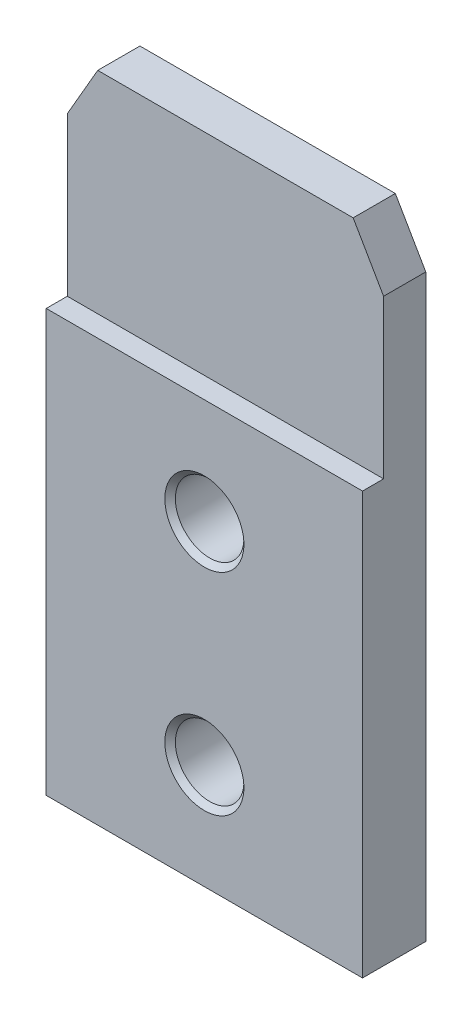
ISO-10303-21;
HEADER;
FILE_DESCRIPTION(('STEP AP214'),'2;1');
FILE_NAME('part.step','',(''),(''),'','','');
FILE_SCHEMA(('AUTOMOTIVE_DESIGN { 1 0 10303 214 1 1 1 1 }'));
ENDSEC;
DATA;
#1=APPLICATION_CONTEXT('core data for automotive mechanical design processes');
#2=APPLICATION_PROTOCOL_DEFINITION('international standard','automotive_design',2000,#1);
#3=PRODUCT_CONTEXT('',#1,'mechanical');
#4=PRODUCT('Part','Part','',(#3));
#5=PRODUCT_RELATED_PRODUCT_CATEGORY('part','',(#4));
#6=PRODUCT_DEFINITION_FORMATION('','',#4);
#7=PRODUCT_DEFINITION_CONTEXT('part definition',#1,'design');
#8=PRODUCT_DEFINITION('design','',#6,#7);
#9=PRODUCT_DEFINITION_SHAPE('','',#8);
#10=(LENGTH_UNIT() NAMED_UNIT(*) SI_UNIT(.MILLI.,.METRE.));
#11=(NAMED_UNIT(*) PLANE_ANGLE_UNIT() SI_UNIT($,.RADIAN.));
#12=(NAMED_UNIT(*) SI_UNIT($,.STERADIAN.) SOLID_ANGLE_UNIT());
#13=UNCERTAINTY_MEASURE_WITH_UNIT(LENGTH_MEASURE(1.E-05),#10,'distance_accuracy_value','');
#14=(GEOMETRIC_REPRESENTATION_CONTEXT(3) GLOBAL_UNCERTAINTY_ASSIGNED_CONTEXT((#13)) GLOBAL_UNIT_ASSIGNED_CONTEXT((#10,
#11,#12)) REPRESENTATION_CONTEXT('',''));
#15=CARTESIAN_POINT('',(0.,0.,0.));
#16=DIRECTION('',(0.,0.,1.));
#17=DIRECTION('',(1.,0.,0.));
#18=AXIS2_PLACEMENT_3D('',#15,#16,#17);
#19=CARTESIAN_POINT('',(0.,0.,6.));
#20=DIRECTION('',(0.,0.,-1.));
#21=DIRECTION('',(-1.,0.,0.));
#22=AXIS2_PLACEMENT_3D('',#19,#20,#21);
#23=PLANE('',#22);
#24=CARTESIAN_POINT('',(0.,0.,6.));
#25=DIRECTION('',(0.,0.,-1.));
#26=DIRECTION('',(-1.,0.,0.));
#27=AXIS2_PLACEMENT_3D('',#24,#25,#26);
#28=CIRCLE('',#27,3.75);
#29=CARTESIAN_POINT('',(-3.75,0.,6.));
#30=VERTEX_POINT('',#29);
#31=EDGE_CURVE('E176',#30,#30,#28,.T.);
#32=ORIENTED_EDGE('',*,*,#31,.T.);
#33=EDGE_LOOP('',(#32));
#34=FACE_BOUND('',#33,.T.);
#35=CARTESIAN_POINT('',(0.,-20.,6.));
#36=DIRECTION('',(0.,0.,-1.));
#37=DIRECTION('',(-1.,0.,0.));
#38=AXIS2_PLACEMENT_3D('',#35,#36,#37);
#39=CIRCLE('',#38,3.74999999999999);
#40=CARTESIAN_POINT('',(-3.74999999999999,-20.,6.));
#41=VERTEX_POINT('',#40);
#42=EDGE_CURVE('E173',#41,#41,#39,.T.);
#43=ORIENTED_EDGE('',*,*,#42,.T.);
#44=EDGE_LOOP('',(#43));
#45=FACE_BOUND('',#44,.T.);
#46=DIRECTION('',(1.,0.,0.));
#47=VECTOR('',#46,1.);
#48=CARTESIAN_POINT('',(-15.,10.,6.));
#49=LINE('',#48,#47);
#50=CARTESIAN_POINT('',(-15.,10.,6.));
#51=VERTEX_POINT('',#50);
#52=CARTESIAN_POINT('',(15.,10.,6.));
#53=VERTEX_POINT('',#52);
#54=EDGE_CURVE('E105',#51,#53,#49,.T.);
#55=ORIENTED_EDGE('',*,*,#54,.F.);
#56=DIRECTION('',(0.,-1.,0.));
#57=VECTOR('',#56,1.);
#58=CARTESIAN_POINT('',(-15.,-30.,6.));
#59=LINE('',#58,#57);
#60=CARTESIAN_POINT('',(-15.,-30.,6.));
#61=VERTEX_POINT('',#60);
#62=EDGE_CURVE('E116',#51,#61,#59,.T.);
#63=ORIENTED_EDGE('',*,*,#62,.T.);
#64=DIRECTION('',(1.,0.,0.));
#65=VECTOR('',#64,1.);
#66=CARTESIAN_POINT('',(-15.,-30.,6.));
#67=LINE('',#66,#65);
#68=CARTESIAN_POINT('',(15.,-30.,6.));
#69=VERTEX_POINT('',#68);
#70=EDGE_CURVE('E125',#61,#69,#67,.T.);
#71=ORIENTED_EDGE('',*,*,#70,.T.);
#72=DIRECTION('',(0.,1.,0.));
#73=VECTOR('',#72,1.);
#74=CARTESIAN_POINT('',(15.,-30.,6.));
#75=LINE('',#74,#73);
#76=EDGE_CURVE('E119',#69,#53,#75,.T.);
#77=ORIENTED_EDGE('',*,*,#76,.T.);
#78=EDGE_LOOP('',(#55,#63,#71,#77));
#79=FACE_BOUND('',#78,.T.);
#80=ADVANCED_FACE('F35',(#34,#45,#79),#23,.F.);
#81=CARTESIAN_POINT('',(15.,-30.,6.));
#82=DIRECTION('',(-1.,0.,0.));
#83=DIRECTION('',(0.,0.,1.));
#84=AXIS2_PLACEMENT_3D('',#81,#82,#83);
#85=PLANE('',#84);
#86=DIRECTION('',(0.,1.,0.));
#87=VECTOR('',#86,1.);
#88=CARTESIAN_POINT('',(15.,-30.,0.));
#89=LINE('',#88,#87);
#90=CARTESIAN_POINT('',(15.,-30.,0.));
#91=VERTEX_POINT('',#90);
#92=CARTESIAN_POINT('',(15.,25.,0.));
#93=VERTEX_POINT('',#92);
#94=EDGE_CURVE('E133',#91,#93,#89,.T.);
#95=ORIENTED_EDGE('',*,*,#94,.T.);
#96=DIRECTION('',(0.,0.,1.));
#97=VECTOR('',#96,1.);
#98=CARTESIAN_POINT('',(15.,25.,6.));
#99=LINE('',#98,#97);
#100=CARTESIAN_POINT('',(15.,25.,4.));
#101=VERTEX_POINT('',#100);
#102=EDGE_CURVE('E50',#93,#101,#99,.T.);
#103=ORIENTED_EDGE('',*,*,#102,.T.);
#104=DIRECTION('',(0.,-1.,0.));
#105=VECTOR('',#104,1.);
#106=CARTESIAN_POINT('',(15.,30.,4.));
#107=LINE('',#106,#105);
#108=CARTESIAN_POINT('',(15.,10.,4.));
#109=VERTEX_POINT('',#108);
#110=EDGE_CURVE('E351',#101,#109,#107,.T.);
#111=ORIENTED_EDGE('',*,*,#110,.T.);
#112=DIRECTION('',(0.,0.,1.));
#113=VECTOR('',#112,1.);
#114=CARTESIAN_POINT('',(15.,10.,6.));
#115=LINE('',#114,#113);
#116=EDGE_CURVE('E352',#109,#53,#115,.T.);
#117=ORIENTED_EDGE('',*,*,#116,.T.);
#118=ORIENTED_EDGE('',*,*,#76,.F.);
#119=DIRECTION('',(0.,0.,-1.));
#120=VECTOR('',#119,1.);
#121=CARTESIAN_POINT('',(15.,-30.,6.));
#122=LINE('',#121,#120);
#123=EDGE_CURVE('E127',#69,#91,#122,.T.);
#124=ORIENTED_EDGE('',*,*,#123,.T.);
#125=EDGE_LOOP('',(#95,#103,#111,#117,#118,#124));
#126=FACE_BOUND('',#125,.T.);
#127=ADVANCED_FACE('F193',(#126),#85,.F.);
#128=CARTESIAN_POINT('',(-15.,30.,6.));
#129=DIRECTION('',(0.,-1.,0.));
#130=DIRECTION('',(0.,0.,-1.));
#131=AXIS2_PLACEMENT_3D('',#128,#129,#130);
#132=PLANE('',#131);
#133=DIRECTION('',(1.,0.,0.));
#134=VECTOR('',#133,1.);
#135=CARTESIAN_POINT('',(-15.,30.,4.));
#136=LINE('',#135,#134);
#137=CARTESIAN_POINT('',(-12.1132486540519,30.,4.));
#138=VERTEX_POINT('',#137);
#139=CARTESIAN_POINT('',(12.1132486540519,30.,4.));
#140=VERTEX_POINT('',#139);
#141=EDGE_CURVE('E136',#138,#140,#136,.T.);
#142=ORIENTED_EDGE('',*,*,#141,.T.);
#143=DIRECTION('',(0.,0.,-1.));
#144=VECTOR('',#143,1.);
#145=CARTESIAN_POINT('',(12.1132486540519,30.,6.));
#146=LINE('',#145,#144);
#147=CARTESIAN_POINT('',(12.1132486540519,30.,0.));
#148=VERTEX_POINT('',#147);
#149=EDGE_CURVE('E154',#140,#148,#146,.T.);
#150=ORIENTED_EDGE('',*,*,#149,.T.);
#151=DIRECTION('',(-1.,0.,0.));
#152=VECTOR('',#151,1.);
#153=CARTESIAN_POINT('',(-15.,30.,0.));
#154=LINE('',#153,#152);
#155=CARTESIAN_POINT('',(-12.1132486540519,30.,0.));
#156=VERTEX_POINT('',#155);
#157=EDGE_CURVE('E135',#148,#156,#154,.T.);
#158=ORIENTED_EDGE('',*,*,#157,.T.);
#159=DIRECTION('',(0.,0.,1.));
#160=VECTOR('',#159,1.);
#161=CARTESIAN_POINT('',(-12.1132486540519,30.,6.));
#162=LINE('',#161,#160);
#163=EDGE_CURVE('E150',#156,#138,#162,.T.);
#164=ORIENTED_EDGE('',*,*,#163,.T.);
#165=EDGE_LOOP('',(#142,#150,#158,#164));
#166=FACE_BOUND('',#165,.T.);
#167=ADVANCED_FACE('F201',(#166),#132,.F.);
#168=CARTESIAN_POINT('',(-15.,-30.,6.));
#169=DIRECTION('',(1.,0.,0.));
#170=DIRECTION('',(0.,0.,-1.));
#171=AXIS2_PLACEMENT_3D('',#168,#169,#170);
#172=PLANE('',#171);
#173=DIRECTION('',(0.,-1.,0.));
#174=VECTOR('',#173,1.);
#175=CARTESIAN_POINT('',(-15.,30.,4.));
#176=LINE('',#175,#174);
#177=CARTESIAN_POINT('',(-15.,25.,4.));
#178=VERTEX_POINT('',#177);
#179=CARTESIAN_POINT('',(-15.,10.,4.));
#180=VERTEX_POINT('',#179);
#181=EDGE_CURVE('E112',#178,#180,#176,.T.);
#182=ORIENTED_EDGE('',*,*,#181,.F.);
#183=DIRECTION('',(0.,0.,-1.));
#184=VECTOR('',#183,1.);
#185=CARTESIAN_POINT('',(-15.,25.,6.));
#186=LINE('',#185,#184);
#187=CARTESIAN_POINT('',(-15.,25.,0.));
#188=VERTEX_POINT('',#187);
#189=EDGE_CURVE('E144',#178,#188,#186,.T.);
#190=ORIENTED_EDGE('',*,*,#189,.T.);
#191=DIRECTION('',(0.,-1.,0.));
#192=VECTOR('',#191,1.);
#193=CARTESIAN_POINT('',(-15.,-30.,0.));
#194=LINE('',#193,#192);
#195=CARTESIAN_POINT('',(-15.,-30.,0.));
#196=VERTEX_POINT('',#195);
#197=EDGE_CURVE('E138',#188,#196,#194,.T.);
#198=ORIENTED_EDGE('',*,*,#197,.T.);
#199=DIRECTION('',(0.,0.,-1.));
#200=VECTOR('',#199,1.);
#201=CARTESIAN_POINT('',(-15.,-30.,6.));
#202=LINE('',#201,#200);
#203=EDGE_CURVE('E123',#61,#196,#202,.T.);
#204=ORIENTED_EDGE('',*,*,#203,.F.);
#205=ORIENTED_EDGE('',*,*,#62,.F.);
#206=DIRECTION('',(0.,0.,1.));
#207=VECTOR('',#206,1.);
#208=CARTESIAN_POINT('',(-15.,10.,6.));
#209=LINE('',#208,#207);
#210=EDGE_CURVE('E101',#180,#51,#209,.T.);
#211=ORIENTED_EDGE('',*,*,#210,.F.);
#212=EDGE_LOOP('',(#182,#190,#198,#204,#205,#211));
#213=FACE_BOUND('',#212,.T.);
#214=ADVANCED_FACE('F121',(#213),#172,.F.);
#215=CARTESIAN_POINT('',(0.,0.,0.));
#216=DIRECTION('',(0.,0.,-1.));
#217=DIRECTION('',(-1.,0.,0.));
#218=AXIS2_PLACEMENT_3D('',#215,#216,#217);
#219=PLANE('',#218);
#220=CARTESIAN_POINT('',(0.,0.,0.));
#221=DIRECTION('',(0.,0.,-1.));
#222=DIRECTION('',(-1.,0.,0.));
#223=AXIS2_PLACEMENT_3D('',#220,#221,#222);
#224=CIRCLE('',#223,3.75000000000001);
#225=CARTESIAN_POINT('',(-3.75000000000001,0.,0.));
#226=VERTEX_POINT('',#225);
#227=EDGE_CURVE('E164',#226,#226,#224,.F.);
#228=ORIENTED_EDGE('',*,*,#227,.T.);
#229=EDGE_LOOP('',(#228));
#230=FACE_BOUND('',#229,.T.);
#231=CARTESIAN_POINT('',(0.,-20.,0.));
#232=DIRECTION('',(0.,0.,-1.));
#233=DIRECTION('',(-1.,0.,0.));
#234=AXIS2_PLACEMENT_3D('',#231,#232,#233);
#235=CIRCLE('',#234,3.74999999999999);
#236=CARTESIAN_POINT('',(-3.74999999999999,-20.,0.));
#237=VERTEX_POINT('',#236);
#238=EDGE_CURVE('E161',#237,#237,#235,.F.);
#239=ORIENTED_EDGE('',*,*,#238,.T.);
#240=EDGE_LOOP('',(#239));
#241=FACE_BOUND('',#240,.T.);
#242=ORIENTED_EDGE('',*,*,#157,.F.);
#243=DIRECTION('',(-0.499999999999998,0.86602540378444,0.));
#244=VECTOR('',#243,1.);
#245=CARTESIAN_POINT('',(22.0753175473055,12.7451905283832,0.));
#246=LINE('',#245,#244);
#247=EDGE_CURVE('E58',#148,#93,#246,.F.);
#248=ORIENTED_EDGE('',*,*,#247,.T.);
#249=ORIENTED_EDGE('',*,*,#94,.F.);
#250=DIRECTION('',(1.,0.,0.));
#251=VECTOR('',#250,1.);
#252=CARTESIAN_POINT('',(-15.,-30.,0.));
#253=LINE('',#252,#251);
#254=EDGE_CURVE('E129',#196,#91,#253,.T.);
#255=ORIENTED_EDGE('',*,*,#254,.F.);
#256=ORIENTED_EDGE('',*,*,#197,.F.);
#257=DIRECTION('',(-0.499999999999998,-0.86602540378444,0.));
#258=VECTOR('',#257,1.);
#259=CARTESIAN_POINT('',(-22.0753175473055,12.7451905283832,0.));
#260=LINE('',#259,#258);
#261=EDGE_CURVE('E147',#188,#156,#260,.F.);
#262=ORIENTED_EDGE('',*,*,#261,.T.);
#263=EDGE_LOOP('',(#242,#248,#249,#255,#256,#262));
#264=FACE_BOUND('',#263,.T.);
#265=ADVANCED_FACE('F207',(#230,#241,#264),#219,.T.);
#266=CARTESIAN_POINT('',(-15.,-30.,6.));
#267=DIRECTION('',(0.,1.,0.));
#268=DIRECTION('',(0.,0.,1.));
#269=AXIS2_PLACEMENT_3D('',#266,#267,#268);
#270=PLANE('',#269);
#271=ORIENTED_EDGE('',*,*,#254,.T.);
#272=ORIENTED_EDGE('',*,*,#123,.F.);
#273=ORIENTED_EDGE('',*,*,#70,.F.);
#274=ORIENTED_EDGE('',*,*,#203,.T.);
#275=EDGE_LOOP('',(#271,#272,#273,#274));
#276=FACE_BOUND('',#275,.T.);
#277=ADVANCED_FACE('F209',(#276),#270,.F.);
#278=CARTESIAN_POINT('',(0.,-20.,6.));
#279=DIRECTION('',(0.,0.,-1.));
#280=DIRECTION('',(-1.,0.,0.));
#281=AXIS2_PLACEMENT_3D('',#278,#279,#280);
#282=CYLINDRICAL_SURFACE('',#281,3.25);
#283=CARTESIAN_POINT('',(0.,-20.,0.499999999999992));
#284=DIRECTION('',(0.,0.,-1.));
#285=DIRECTION('',(-1.,0.,0.));
#286=AXIS2_PLACEMENT_3D('',#283,#284,#285);
#287=CIRCLE('',#286,3.25);
#288=CARTESIAN_POINT('',(-3.25,-20.,0.499999999999992));
#289=VERTEX_POINT('',#288);
#290=EDGE_CURVE('E11',#289,#289,#287,.T.);
#291=ORIENTED_EDGE('',*,*,#290,.T.);
#292=EDGE_LOOP('',(#291));
#293=FACE_BOUND('',#292,.T.);
#294=CARTESIAN_POINT('',(0.,-20.,5.50000000000002));
#295=DIRECTION('',(0.,0.,-1.));
#296=DIRECTION('',(-1.,0.,0.));
#297=AXIS2_PLACEMENT_3D('',#294,#295,#296);
#298=CIRCLE('',#297,3.25);
#299=CARTESIAN_POINT('',(-3.25,-20.,5.50000000000002));
#300=VERTEX_POINT('',#299);
#301=EDGE_CURVE('E43',#300,#300,#298,.F.);
#302=ORIENTED_EDGE('',*,*,#301,.T.);
#303=EDGE_LOOP('',(#302));
#304=FACE_BOUND('',#303,.T.);
#305=ADVANCED_FACE('F181',(#293,#304),#282,.F.);
#306=CARTESIAN_POINT('',(0.,0.,6.));
#307=DIRECTION('',(0.,0.,-1.));
#308=DIRECTION('',(-1.,0.,0.));
#309=AXIS2_PLACEMENT_3D('',#306,#307,#308);
#310=CYLINDRICAL_SURFACE('',#309,3.25);
#311=CARTESIAN_POINT('',(0.,0.,0.500000000000013));
#312=DIRECTION('',(0.,0.,-1.));
#313=DIRECTION('',(-1.,0.,0.));
#314=AXIS2_PLACEMENT_3D('',#311,#312,#313);
#315=CIRCLE('',#314,3.25);
#316=CARTESIAN_POINT('',(-3.25,0.,0.500000000000013));
#317=VERTEX_POINT('',#316);
#318=EDGE_CURVE('E170',#317,#317,#315,.T.);
#319=ORIENTED_EDGE('',*,*,#318,.T.);
#320=EDGE_LOOP('',(#319));
#321=FACE_BOUND('',#320,.T.);
#322=CARTESIAN_POINT('',(0.,0.,5.50000000000001));
#323=DIRECTION('',(0.,0.,-1.));
#324=DIRECTION('',(-1.,0.,0.));
#325=AXIS2_PLACEMENT_3D('',#322,#323,#324);
#326=CIRCLE('',#325,3.25);
#327=CARTESIAN_POINT('',(-3.25,0.,5.50000000000001));
#328=VERTEX_POINT('',#327);
#329=EDGE_CURVE('E167',#328,#328,#326,.F.);
#330=ORIENTED_EDGE('',*,*,#329,.T.);
#331=EDGE_LOOP('',(#330));
#332=FACE_BOUND('',#331,.T.);
#333=ADVANCED_FACE('F239',(#321,#332),#310,.F.);
#334=CARTESIAN_POINT('',(-15.,30.,4.));
#335=DIRECTION('',(0.,0.,1.));
#336=DIRECTION('',(0.,-1.,0.));
#337=AXIS2_PLACEMENT_3D('',#334,#335,#336);
#338=PLANE('',#337);
#339=ORIENTED_EDGE('',*,*,#110,.F.);
#340=DIRECTION('',(0.499999999999998,-0.86602540378444,0.));
#341=VECTOR('',#340,1.);
#342=CARTESIAN_POINT('',(5.33493649053896,41.7403810567666,4.));
#343=LINE('',#342,#341);
#344=EDGE_CURVE('E159',#101,#140,#343,.F.);
#345=ORIENTED_EDGE('',*,*,#344,.T.);
#346=ORIENTED_EDGE('',*,*,#141,.F.);
#347=DIRECTION('',(0.499999999999998,0.86602540378444,0.));
#348=VECTOR('',#347,1.);
#349=CARTESIAN_POINT('',(-12.8349364905389,28.75,4.));
#350=LINE('',#349,#348);
#351=EDGE_CURVE('E152',#138,#178,#350,.F.);
#352=ORIENTED_EDGE('',*,*,#351,.T.);
#353=ORIENTED_EDGE('',*,*,#181,.T.);
#354=DIRECTION('',(1.,0.,0.));
#355=VECTOR('',#354,1.);
#356=CARTESIAN_POINT('',(-15.,10.,4.));
#357=LINE('',#356,#355);
#358=EDGE_CURVE('E108',#180,#109,#357,.T.);
#359=ORIENTED_EDGE('',*,*,#358,.T.);
#360=EDGE_LOOP('',(#339,#345,#346,#352,#353,#359));
#361=FACE_BOUND('',#360,.T.);
#362=ADVANCED_FACE('F241',(#361),#338,.T.);
#363=CARTESIAN_POINT('',(-15.,10.,6.));
#364=DIRECTION('',(0.,1.,0.));
#365=DIRECTION('',(0.,0.,1.));
#366=AXIS2_PLACEMENT_3D('',#363,#364,#365);
#367=PLANE('',#366);
#368=ORIENTED_EDGE('',*,*,#116,.F.);
#369=ORIENTED_EDGE('',*,*,#358,.F.);
#370=ORIENTED_EDGE('',*,*,#210,.T.);
#371=ORIENTED_EDGE('',*,*,#54,.T.);
#372=EDGE_LOOP('',(#368,#369,#370,#371));
#373=FACE_BOUND('',#372,.T.);
#374=ADVANCED_FACE('F104',(#373),#367,.T.);
#375=CARTESIAN_POINT('',(-15.,25.,6.));
#376=DIRECTION('',(0.86602540378444,-0.499999999999998,0.));
#377=DIRECTION('',(0.,0.,-1.));
#378=AXIS2_PLACEMENT_3D('',#375,#376,#377);
#379=PLANE('',#378);
#380=ORIENTED_EDGE('',*,*,#351,.F.);
#381=ORIENTED_EDGE('',*,*,#163,.F.);
#382=ORIENTED_EDGE('',*,*,#261,.F.);
#383=ORIENTED_EDGE('',*,*,#189,.F.);
#384=EDGE_LOOP('',(#380,#381,#382,#383));
#385=FACE_BOUND('',#384,.T.);
#386=ADVANCED_FACE('F219',(#385),#379,.F.);
#387=CARTESIAN_POINT('',(12.1132486540519,30.,6.));
#388=DIRECTION('',(-0.86602540378444,-0.499999999999998,0.));
#389=DIRECTION('',(0.,0.,-1.));
#390=AXIS2_PLACEMENT_3D('',#387,#388,#389);
#391=PLANE('',#390);
#392=ORIENTED_EDGE('',*,*,#344,.F.);
#393=ORIENTED_EDGE('',*,*,#102,.F.);
#394=ORIENTED_EDGE('',*,*,#247,.F.);
#395=ORIENTED_EDGE('',*,*,#149,.F.);
#396=EDGE_LOOP('',(#392,#393,#394,#395));
#397=FACE_BOUND('',#396,.T.);
#398=ADVANCED_FACE('F222',(#397),#391,.F.);
#399=CARTESIAN_POINT('',(0.,0.,0.));
#400=DIRECTION('',(0.,0.,-1.));
#401=DIRECTION('',(-1.,0.,0.));
#402=AXIS2_PLACEMENT_3D('',#399,#400,#401);
#403=CONICAL_SURFACE('',#402,3.75000000000001,0.785398163397446);
#404=ORIENTED_EDGE('',*,*,#318,.F.);
#405=EDGE_LOOP('',(#404));
#406=FACE_BOUND('',#405,.T.);
#407=ORIENTED_EDGE('',*,*,#227,.F.);
#408=EDGE_LOOP('',(#407));
#409=FACE_BOUND('',#408,.T.);
#410=ADVANCED_FACE('F226',(#406,#409),#403,.F.);
#411=CARTESIAN_POINT('',(0.,0.,5.50000000000001));
#412=DIRECTION('',(0.,0.,1.));
#413=DIRECTION('',(1.,0.,0.));
#414=AXIS2_PLACEMENT_3D('',#411,#412,#413);
#415=CONICAL_SURFACE('',#414,3.25,0.785398163397458);
#416=ORIENTED_EDGE('',*,*,#31,.F.);
#417=EDGE_LOOP('',(#416));
#418=FACE_BOUND('',#417,.T.);
#419=ORIENTED_EDGE('',*,*,#329,.F.);
#420=EDGE_LOOP('',(#419));
#421=FACE_BOUND('',#420,.T.);
#422=ADVANCED_FACE('F189',(#418,#421),#415,.F.);
#423=CARTESIAN_POINT('',(0.,-20.,0.));
#424=DIRECTION('',(0.,0.,-1.));
#425=DIRECTION('',(-1.,0.,0.));
#426=AXIS2_PLACEMENT_3D('',#423,#424,#425);
#427=CONICAL_SURFACE('',#426,3.74999999999999,0.785398163397446);
#428=ORIENTED_EDGE('',*,*,#290,.F.);
#429=EDGE_LOOP('',(#428));
#430=FACE_BOUND('',#429,.T.);
#431=ORIENTED_EDGE('',*,*,#238,.F.);
#432=EDGE_LOOP('',(#431));
#433=FACE_BOUND('',#432,.T.);
#434=ADVANCED_FACE('F184',(#430,#433),#427,.F.);
#435=CARTESIAN_POINT('',(0.,-20.,5.50000000000002));
#436=DIRECTION('',(0.,0.,1.));
#437=DIRECTION('',(1.,0.,0.));
#438=AXIS2_PLACEMENT_3D('',#435,#436,#437);
#439=CONICAL_SURFACE('',#438,3.25,0.785398163397457);
#440=ORIENTED_EDGE('',*,*,#42,.F.);
#441=EDGE_LOOP('',(#440));
#442=FACE_BOUND('',#441,.T.);
#443=ORIENTED_EDGE('',*,*,#301,.F.);
#444=EDGE_LOOP('',(#443));
#445=FACE_BOUND('',#444,.T.);
#446=ADVANCED_FACE('F37',(#442,#445),#439,.F.);
#447=CLOSED_SHELL('',(#80,#127,#167,#214,#265,#277,#305,#333,#362,#374,#386,#398,#410,#422,#434,#446));
#448=MANIFOLD_SOLID_BREP('B2',#447);
#449=ADVANCED_BREP_SHAPE_REPRESENTATION('',(#18,#448),#14);
#450=SHAPE_DEFINITION_REPRESENTATION(#9,#449);
ENDSEC;
END-ISO-10303-21;
